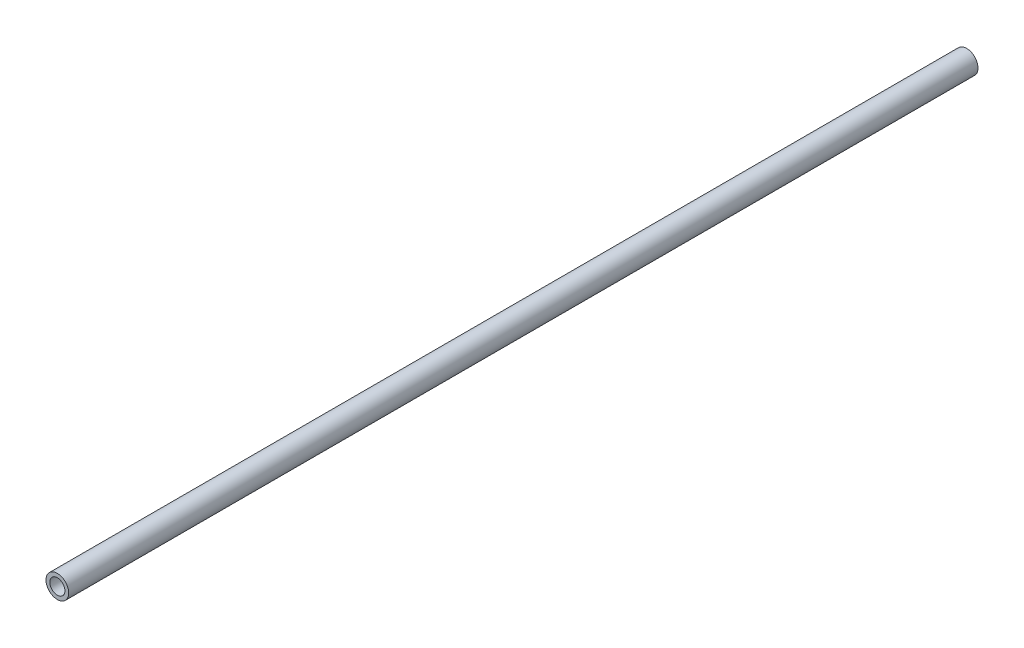
ISO-10303-21;
HEADER;
FILE_DESCRIPTION(('STEP AP214'),'2;1');
FILE_NAME('part.step','',(''),(''),'','','');
FILE_SCHEMA(('AUTOMOTIVE_DESIGN { 1 0 10303 214 1 1 1 1 }'));
ENDSEC;
DATA;
#1=APPLICATION_CONTEXT('core data for automotive mechanical design processes');
#2=APPLICATION_PROTOCOL_DEFINITION('international standard','automotive_design',2000,#1);
#3=PRODUCT_CONTEXT('',#1,'mechanical');
#4=PRODUCT('Part','Part','',(#3));
#5=PRODUCT_RELATED_PRODUCT_CATEGORY('part','',(#4));
#6=PRODUCT_DEFINITION_FORMATION('','',#4);
#7=PRODUCT_DEFINITION_CONTEXT('part definition',#1,'design');
#8=PRODUCT_DEFINITION('design','',#6,#7);
#9=PRODUCT_DEFINITION_SHAPE('','',#8);
#10=(LENGTH_UNIT() NAMED_UNIT(*) SI_UNIT(.MILLI.,.METRE.));
#11=(NAMED_UNIT(*) PLANE_ANGLE_UNIT() SI_UNIT($,.RADIAN.));
#12=(NAMED_UNIT(*) SI_UNIT($,.STERADIAN.) SOLID_ANGLE_UNIT());
#13=UNCERTAINTY_MEASURE_WITH_UNIT(LENGTH_MEASURE(1.E-05),#10,'distance_accuracy_value','');
#14=(GEOMETRIC_REPRESENTATION_CONTEXT(3) GLOBAL_UNCERTAINTY_ASSIGNED_CONTEXT((#13)) GLOBAL_UNIT_ASSIGNED_CONTEXT((#10,
#11,#12)) REPRESENTATION_CONTEXT('',''));
#15=CARTESIAN_POINT('',(0.,0.,0.));
#16=DIRECTION('',(0.,0.,1.));
#17=DIRECTION('',(1.,0.,0.));
#18=AXIS2_PLACEMENT_3D('',#15,#16,#17);
#19=CARTESIAN_POINT('',(0.,0.,609.6));
#20=DIRECTION('',(0.,0.,1.));
#21=DIRECTION('',(1.,0.,0.));
#22=AXIS2_PLACEMENT_3D('',#19,#20,#21);
#23=PLANE('',#22);
#24=CARTESIAN_POINT('',(0.,0.,609.6));
#25=DIRECTION('',(0.,0.,1.));
#26=DIRECTION('',(1.,0.,0.));
#27=AXIS2_PLACEMENT_3D('',#24,#25,#26);
#28=CIRCLE('',#27,7.62);
#29=CARTESIAN_POINT('',(7.62,0.,609.6));
#30=VERTEX_POINT('',#29);
#31=EDGE_CURVE('E10',#30,#30,#28,.T.);
#32=ORIENTED_EDGE('',*,*,#31,.T.);
#33=EDGE_LOOP('',(#32));
#34=FACE_BOUND('',#33,.T.);
#35=CARTESIAN_POINT('',(0.,0.,609.6));
#36=DIRECTION('',(0.,0.,1.));
#37=DIRECTION('',(1.,0.,0.));
#38=AXIS2_PLACEMENT_3D('',#35,#36,#37);
#39=CIRCLE('',#38,5.08);
#40=CARTESIAN_POINT('',(5.08,0.,609.6));
#41=VERTEX_POINT('',#40);
#42=EDGE_CURVE('E41',#41,#41,#39,.T.);
#43=ORIENTED_EDGE('',*,*,#42,.F.);
#44=EDGE_LOOP('',(#43));
#45=FACE_BOUND('',#44,.T.);
#46=ADVANCED_FACE('F30',(#34,#45),#23,.T.);
#47=CARTESIAN_POINT('',(0.,0.,0.));
#48=DIRECTION('',(0.,0.,1.));
#49=DIRECTION('',(1.,0.,0.));
#50=AXIS2_PLACEMENT_3D('',#47,#48,#49);
#51=PLANE('',#50);
#52=CARTESIAN_POINT('',(0.,0.,0.));
#53=DIRECTION('',(0.,0.,1.));
#54=DIRECTION('',(1.,0.,0.));
#55=AXIS2_PLACEMENT_3D('',#52,#53,#54);
#56=CIRCLE('',#55,7.62);
#57=CARTESIAN_POINT('',(7.62,0.,0.));
#58=VERTEX_POINT('',#57);
#59=EDGE_CURVE('E34',#58,#58,#56,.T.);
#60=ORIENTED_EDGE('',*,*,#59,.F.);
#61=EDGE_LOOP('',(#60));
#62=FACE_BOUND('',#61,.T.);
#63=CARTESIAN_POINT('',(0.,0.,0.));
#64=DIRECTION('',(0.,0.,1.));
#65=DIRECTION('',(1.,0.,0.));
#66=AXIS2_PLACEMENT_3D('',#63,#64,#65);
#67=CIRCLE('',#66,5.08);
#68=CARTESIAN_POINT('',(5.08,0.,0.));
#69=VERTEX_POINT('',#68);
#70=EDGE_CURVE('E43',#69,#69,#67,.T.);
#71=ORIENTED_EDGE('',*,*,#70,.T.);
#72=EDGE_LOOP('',(#71));
#73=FACE_BOUND('',#72,.T.);
#74=ADVANCED_FACE('F53',(#62,#73),#51,.F.);
#75=CARTESIAN_POINT('',(0.,0.,609.6));
#76=DIRECTION('',(0.,0.,-1.));
#77=DIRECTION('',(-1.,0.,0.));
#78=AXIS2_PLACEMENT_3D('',#75,#76,#77);
#79=CYLINDRICAL_SURFACE('',#78,7.62);
#80=ORIENTED_EDGE('',*,*,#31,.F.);
#81=EDGE_LOOP('',(#80));
#82=FACE_BOUND('',#81,.T.);
#83=ORIENTED_EDGE('',*,*,#59,.T.);
#84=EDGE_LOOP('',(#83));
#85=FACE_BOUND('',#84,.T.);
#86=ADVANCED_FACE('F32',(#82,#85),#79,.T.);
#87=CARTESIAN_POINT('',(0.,0.,609.6));
#88=DIRECTION('',(0.,0.,-1.));
#89=DIRECTION('',(-1.,0.,0.));
#90=AXIS2_PLACEMENT_3D('',#87,#88,#89);
#91=CYLINDRICAL_SURFACE('',#90,5.08);
#92=ORIENTED_EDGE('',*,*,#42,.T.);
#93=EDGE_LOOP('',(#92));
#94=FACE_BOUND('',#93,.T.);
#95=ORIENTED_EDGE('',*,*,#70,.F.);
#96=EDGE_LOOP('',(#95));
#97=FACE_BOUND('',#96,.T.);
#98=ADVANCED_FACE('F49',(#94,#97),#91,.F.);
#99=CLOSED_SHELL('',(#46,#74,#86,#98));
#100=MANIFOLD_SOLID_BREP('B2',#99);
#101=ADVANCED_BREP_SHAPE_REPRESENTATION('',(#18,#100),#14);
#102=SHAPE_DEFINITION_REPRESENTATION(#9,#101);
ENDSEC;
END-ISO-10303-21;
